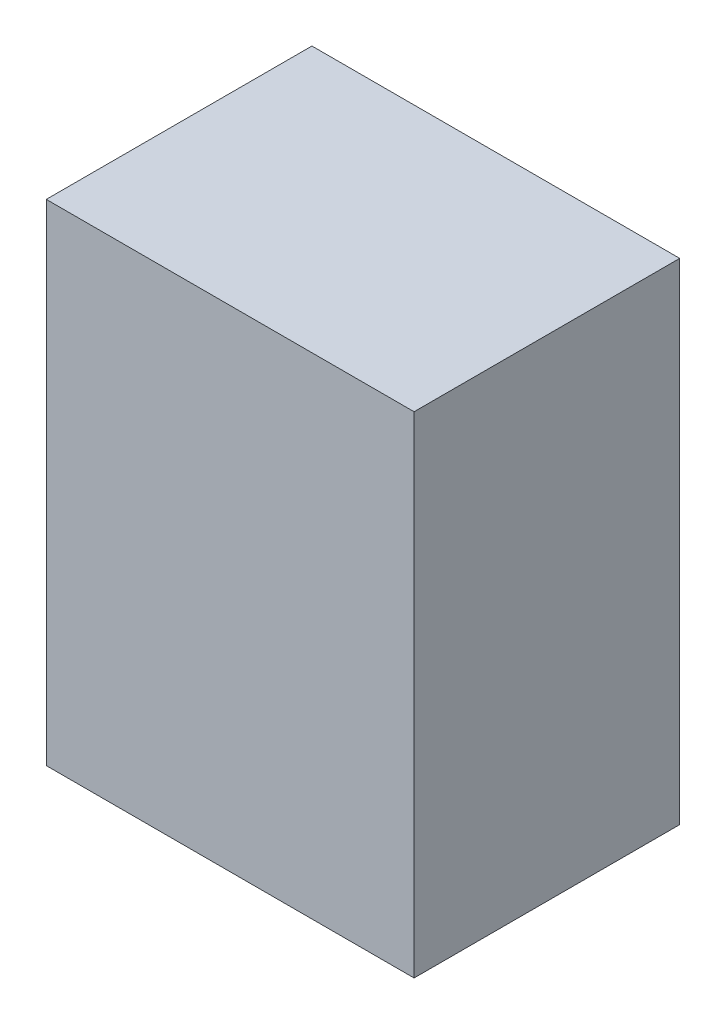
ISO-10303-21;
HEADER;
FILE_DESCRIPTION(('STEP AP214'),'2;1');
FILE_NAME('part.step','',(''),(''),'','','');
FILE_SCHEMA(('AUTOMOTIVE_DESIGN { 1 0 10303 214 1 1 1 1 }'));
ENDSEC;
DATA;
#1=APPLICATION_CONTEXT('core data for automotive mechanical design processes');
#2=APPLICATION_PROTOCOL_DEFINITION('international standard','automotive_design',2000,#1);
#3=PRODUCT_CONTEXT('',#1,'mechanical');
#4=PRODUCT('Part','Part','',(#3));
#5=PRODUCT_RELATED_PRODUCT_CATEGORY('part','',(#4));
#6=PRODUCT_DEFINITION_FORMATION('','',#4);
#7=PRODUCT_DEFINITION_CONTEXT('part definition',#1,'design');
#8=PRODUCT_DEFINITION('design','',#6,#7);
#9=PRODUCT_DEFINITION_SHAPE('','',#8);
#10=(LENGTH_UNIT() NAMED_UNIT(*) SI_UNIT(.MILLI.,.METRE.));
#11=(NAMED_UNIT(*) PLANE_ANGLE_UNIT() SI_UNIT($,.RADIAN.));
#12=(NAMED_UNIT(*) SI_UNIT($,.STERADIAN.) SOLID_ANGLE_UNIT());
#13=UNCERTAINTY_MEASURE_WITH_UNIT(LENGTH_MEASURE(1.E-05),#10,'distance_accuracy_value','');
#14=(GEOMETRIC_REPRESENTATION_CONTEXT(3) GLOBAL_UNCERTAINTY_ASSIGNED_CONTEXT((#13)) GLOBAL_UNIT_ASSIGNED_CONTEXT((#10,
#11,#12)) REPRESENTATION_CONTEXT('',''));
#15=CARTESIAN_POINT('',(0.,0.,0.));
#16=DIRECTION('',(0.,0.,1.));
#17=DIRECTION('',(1.,0.,0.));
#18=AXIS2_PLACEMENT_3D('',#15,#16,#17);
#19=CARTESIAN_POINT('',(-0.8999982,-1.20000014,1.29999994));
#20=DIRECTION('',(0.,0.,-1.));
#21=DIRECTION('',(-1.,0.,0.));
#22=AXIS2_PLACEMENT_3D('',#19,#20,#21);
#23=PLANE('',#22);
#24=DIRECTION('',(0.,1.,0.));
#25=VECTOR('',#24,1.);
#26=CARTESIAN_POINT('',(0.90000074,-1.20000014,1.29999994));
#27=LINE('',#26,#25);
#28=CARTESIAN_POINT('',(0.90000074,-1.20000014,1.29999994));
#29=VERTEX_POINT('',#28);
#30=CARTESIAN_POINT('',(0.90000074,1.20000014,1.29999994));
#31=VERTEX_POINT('',#30);
#32=EDGE_CURVE('E55',#29,#31,#27,.T.);
#33=ORIENTED_EDGE('',*,*,#32,.T.);
#34=DIRECTION('',(1.,0.,0.));
#35=VECTOR('',#34,1.);
#36=CARTESIAN_POINT('',(0.90000074,1.20000014,1.29999994));
#37=LINE('',#36,#35);
#38=CARTESIAN_POINT('',(-0.8999982,1.20000014,1.29999994));
#39=VERTEX_POINT('',#38);
#40=EDGE_CURVE('E57',#31,#39,#37,.F.);
#41=ORIENTED_EDGE('',*,*,#40,.T.);
#42=DIRECTION('',(0.,1.,0.));
#43=VECTOR('',#42,1.);
#44=CARTESIAN_POINT('',(-0.8999982,1.20000014,1.29999994));
#45=LINE('',#44,#43);
#46=CARTESIAN_POINT('',(-0.8999982,-1.20000014,1.29999994));
#47=VERTEX_POINT('',#46);
#48=EDGE_CURVE('E20',#39,#47,#45,.F.);
#49=ORIENTED_EDGE('',*,*,#48,.T.);
#50=DIRECTION('',(1.,0.,0.));
#51=VECTOR('',#50,1.);
#52=CARTESIAN_POINT('',(-0.8999982,-1.20000014,1.29999994));
#53=LINE('',#52,#51);
#54=EDGE_CURVE('E80',#47,#29,#53,.T.);
#55=ORIENTED_EDGE('',*,*,#54,.T.);
#56=EDGE_LOOP('',(#33,#41,#49,#55));
#57=FACE_BOUND('',#56,.T.);
#58=ADVANCED_FACE('F17',(#57),#23,.F.);
#59=CARTESIAN_POINT('',(-0.8999982,1.20000014,0.));
#60=DIRECTION('',(1.,0.,0.));
#61=DIRECTION('',(0.,0.,-1.));
#62=AXIS2_PLACEMENT_3D('',#59,#60,#61);
#63=PLANE('',#62);
#64=DIRECTION('',(0.,0.,1.));
#65=VECTOR('',#64,1.);
#66=CARTESIAN_POINT('',(-0.8999982,-1.20000014,0.));
#67=LINE('',#66,#65);
#68=CARTESIAN_POINT('',(-0.8999982,-1.20000014,0.));
#69=VERTEX_POINT('',#68);
#70=EDGE_CURVE('E68',#69,#47,#67,.T.);
#71=ORIENTED_EDGE('',*,*,#70,.T.);
#72=ORIENTED_EDGE('',*,*,#48,.F.);
#73=DIRECTION('',(0.,0.,-1.));
#74=VECTOR('',#73,1.);
#75=CARTESIAN_POINT('',(-0.8999982,1.20000014,0.));
#76=LINE('',#75,#74);
#77=CARTESIAN_POINT('',(-0.8999982,1.20000014,0.));
#78=VERTEX_POINT('',#77);
#79=EDGE_CURVE('E63',#39,#78,#76,.T.);
#80=ORIENTED_EDGE('',*,*,#79,.T.);
#81=DIRECTION('',(0.,1.,0.));
#82=VECTOR('',#81,1.);
#83=CARTESIAN_POINT('',(-0.8999982,-1.20000014,0.));
#84=LINE('',#83,#82);
#85=EDGE_CURVE('E83',#69,#78,#84,.T.);
#86=ORIENTED_EDGE('',*,*,#85,.F.);
#87=EDGE_LOOP('',(#71,#72,#80,#86));
#88=FACE_BOUND('',#87,.T.);
#89=ADVANCED_FACE('F65',(#88),#63,.F.);
#90=CARTESIAN_POINT('',(0.90000074,1.20000014,0.));
#91=DIRECTION('',(0.,-1.,0.));
#92=DIRECTION('',(0.,0.,-1.));
#93=AXIS2_PLACEMENT_3D('',#90,#91,#92);
#94=PLANE('',#93);
#95=ORIENTED_EDGE('',*,*,#79,.F.);
#96=ORIENTED_EDGE('',*,*,#40,.F.);
#97=DIRECTION('',(0.,0.,1.));
#98=VECTOR('',#97,1.);
#99=CARTESIAN_POINT('',(0.90000074,1.20000014,0.));
#100=LINE('',#99,#98);
#101=CARTESIAN_POINT('',(0.90000074,1.20000014,0.));
#102=VERTEX_POINT('',#101);
#103=EDGE_CURVE('E75',#31,#102,#100,.F.);
#104=ORIENTED_EDGE('',*,*,#103,.T.);
#105=DIRECTION('',(-1.,0.,0.));
#106=VECTOR('',#105,1.);
#107=CARTESIAN_POINT('',(-0.8999982,1.20000014,0.));
#108=LINE('',#107,#106);
#109=EDGE_CURVE('E72',#78,#102,#108,.F.);
#110=ORIENTED_EDGE('',*,*,#109,.F.);
#111=EDGE_LOOP('',(#95,#96,#104,#110));
#112=FACE_BOUND('',#111,.T.);
#113=ADVANCED_FACE('F70',(#112),#94,.F.);
#114=CARTESIAN_POINT('',(0.90000074,-1.20000014,0.));
#115=DIRECTION('',(-1.,0.,0.));
#116=DIRECTION('',(0.,0.,1.));
#117=AXIS2_PLACEMENT_3D('',#114,#115,#116);
#118=PLANE('',#117);
#119=ORIENTED_EDGE('',*,*,#103,.F.);
#120=ORIENTED_EDGE('',*,*,#32,.F.);
#121=DIRECTION('',(0.,0.,1.));
#122=VECTOR('',#121,1.);
#123=CARTESIAN_POINT('',(0.90000074,-1.20000014,0.));
#124=LINE('',#123,#122);
#125=CARTESIAN_POINT('',(0.90000074,-1.20000014,0.));
#126=VERTEX_POINT('',#125);
#127=EDGE_CURVE('E35',#29,#126,#124,.F.);
#128=ORIENTED_EDGE('',*,*,#127,.T.);
#129=DIRECTION('',(0.,1.,0.));
#130=VECTOR('',#129,1.);
#131=CARTESIAN_POINT('',(0.90000074,-1.20000014,0.));
#132=LINE('',#131,#130);
#133=EDGE_CURVE('E26',#102,#126,#132,.F.);
#134=ORIENTED_EDGE('',*,*,#133,.F.);
#135=EDGE_LOOP('',(#119,#120,#128,#134));
#136=FACE_BOUND('',#135,.T.);
#137=ADVANCED_FACE('F89',(#136),#118,.F.);
#138=CARTESIAN_POINT('',(-0.8999982,-1.20000014,0.));
#139=DIRECTION('',(0.,1.,0.));
#140=DIRECTION('',(0.,0.,1.));
#141=AXIS2_PLACEMENT_3D('',#138,#139,#140);
#142=PLANE('',#141);
#143=ORIENTED_EDGE('',*,*,#127,.F.);
#144=ORIENTED_EDGE('',*,*,#54,.F.);
#145=ORIENTED_EDGE('',*,*,#70,.F.);
#146=DIRECTION('',(-1.,0.,0.));
#147=VECTOR('',#146,1.);
#148=CARTESIAN_POINT('',(-0.8999982,-1.20000014,0.));
#149=LINE('',#148,#147);
#150=EDGE_CURVE('E11',#126,#69,#149,.T.);
#151=ORIENTED_EDGE('',*,*,#150,.F.);
#152=EDGE_LOOP('',(#143,#144,#145,#151));
#153=FACE_BOUND('',#152,.T.);
#154=ADVANCED_FACE('F91',(#153),#142,.F.);
#155=CARTESIAN_POINT('',(-0.8999982,-1.20000014,0.));
#156=DIRECTION('',(0.,0.,-1.));
#157=DIRECTION('',(-1.,0.,0.));
#158=AXIS2_PLACEMENT_3D('',#155,#156,#157);
#159=PLANE('',#158);
#160=ORIENTED_EDGE('',*,*,#133,.T.);
#161=ORIENTED_EDGE('',*,*,#150,.T.);
#162=ORIENTED_EDGE('',*,*,#85,.T.);
#163=ORIENTED_EDGE('',*,*,#109,.T.);
#164=EDGE_LOOP('',(#160,#161,#162,#163));
#165=FACE_BOUND('',#164,.T.);
#166=ADVANCED_FACE('F88',(#165),#159,.T.);
#167=CLOSED_SHELL('',(#58,#89,#113,#137,#154,#166));
#168=MANIFOLD_SOLID_BREP('B1',#167);
#169=ADVANCED_BREP_SHAPE_REPRESENTATION('',(#18,#168),#14);
#170=SHAPE_DEFINITION_REPRESENTATION(#9,#169);
ENDSEC;
END-ISO-10303-21;
